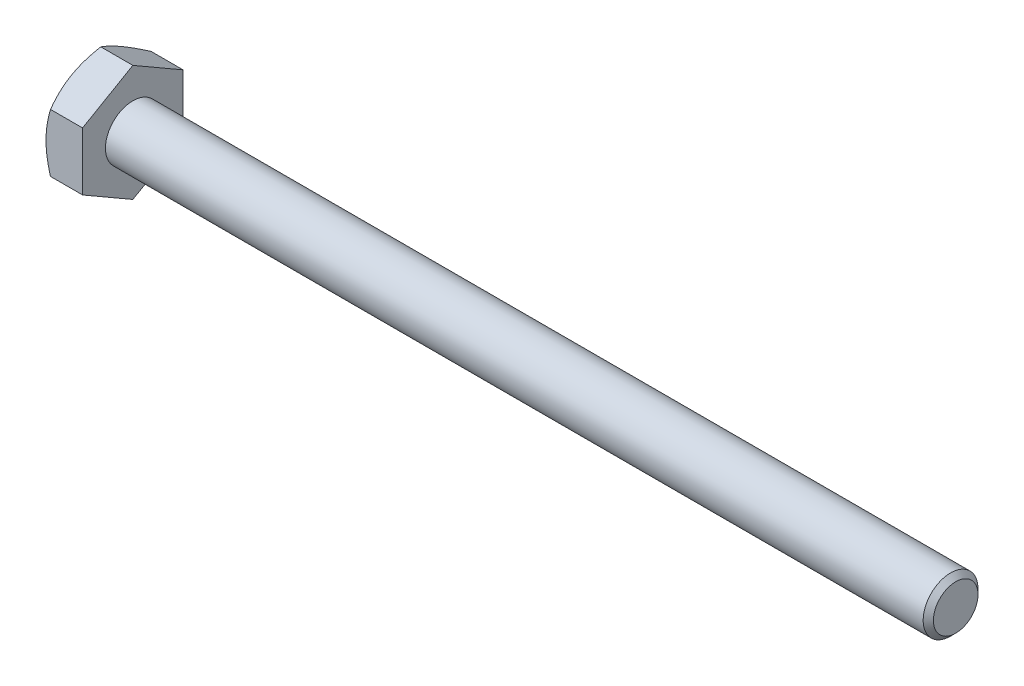
ISO-10303-21;
HEADER;
FILE_DESCRIPTION(('STEP AP214'),'2;1');
FILE_NAME('part.step','',(''),(''),'','','');
FILE_SCHEMA(('AUTOMOTIVE_DESIGN { 1 0 10303 214 1 1 1 1 }'));
ENDSEC;
DATA;
#1=APPLICATION_CONTEXT('core data for automotive mechanical design processes');
#2=APPLICATION_PROTOCOL_DEFINITION('international standard','automotive_design',2000,#1);
#3=PRODUCT_CONTEXT('',#1,'mechanical');
#4=PRODUCT('Part','Part','',(#3));
#5=PRODUCT_RELATED_PRODUCT_CATEGORY('part','',(#4));
#6=PRODUCT_DEFINITION_FORMATION('','',#4);
#7=PRODUCT_DEFINITION_CONTEXT('part definition',#1,'design');
#8=PRODUCT_DEFINITION('design','',#6,#7);
#9=PRODUCT_DEFINITION_SHAPE('','',#8);
#10=(LENGTH_UNIT() NAMED_UNIT(*) SI_UNIT(.MILLI.,.METRE.));
#11=(NAMED_UNIT(*) PLANE_ANGLE_UNIT() SI_UNIT($,.RADIAN.));
#12=(NAMED_UNIT(*) SI_UNIT($,.STERADIAN.) SOLID_ANGLE_UNIT());
#13=UNCERTAINTY_MEASURE_WITH_UNIT(LENGTH_MEASURE(1.E-05),#10,'distance_accuracy_value','');
#14=(GEOMETRIC_REPRESENTATION_CONTEXT(3) GLOBAL_UNCERTAINTY_ASSIGNED_CONTEXT((#13)) GLOBAL_UNIT_ASSIGNED_CONTEXT((#10,
#11,#12)) REPRESENTATION_CONTEXT('',''));
#15=CARTESIAN_POINT('',(0.,0.,0.));
#16=DIRECTION('',(0.,0.,1.));
#17=DIRECTION('',(1.,0.,0.));
#18=AXIS2_PLACEMENT_3D('',#15,#16,#17);
#19=CARTESIAN_POINT('',(0.247093813584343,0.,0.));
#20=DIRECTION('',(1.,0.,0.));
#21=DIRECTION('',(0.,0.,-1.));
#22=AXIS2_PLACEMENT_3D('',#19,#20,#21);
#23=CONICAL_SURFACE('',#22,3.17797903937844,1.04719755121946);
#24=CARTESIAN_POINT('',(0.24562010267378,1.58771322360887,2.75000002886048));
#25=CARTESIAN_POINT('',(0.208302603654191,1.65233281555866,2.63807561243907));
#26=CARTESIAN_POINT('',(0.174113259321967,1.7174699044324,2.52525486505261));
#27=CARTESIAN_POINT('',(0.113820966108115,1.8483182591926,2.29861886652116));
#28=CARTESIAN_POINT('',(0.087678031758483,1.91402496097017,2.18481152064462));
#29=CARTESIAN_POINT('',(0.0555789468438281,2.01320512545803,2.01302643664861));
#30=CARTESIAN_POINT('',(0.046061241370184,2.04639046606418,1.95554774065228));
#31=CARTESIAN_POINT('',(0.0295858947880669,2.1129200190349,1.84031517470215));
#32=CARTESIAN_POINT('',(0.0226281862985192,2.14626422719456,1.78256131203147));
#33=CARTESIAN_POINT('',(0.0113950805088262,2.2132348513754,1.66656478833565));
#34=CARTESIAN_POINT('',(0.00713332390408386,2.24686184378969,1.60832112896836));
#35=CARTESIAN_POINT('',(0.00142988482438796,2.31418196202442,1.49171926381427));
#36=CARTESIAN_POINT('',(-1.12391437539125E-05,2.34787509962031,1.43336103763178));
#37=CARTESIAN_POINT('',(4.72581289227276E-12,2.3815698604072,1.375));
#38=B_SPLINE_CURVE_WITH_KNOTS('',3,(#24,#25,#26,#27,#28,#29,#30,#31,#32,#33,#34,#35,#36,#37),
.UNSPECIFIED.,.F.,.F.,(4,2,2,2,2,2,4),(0.,0.403720170813952,0.805400455121433,1.00650414154214,
1.20760253438159,1.40971045256613,1.61185838561563),.UNSPECIFIED.);
#39=CARTESIAN_POINT('',(0.2456200978637,1.58771323194017,2.75000001443024));
#40=VERTEX_POINT('',#39);
#41=CARTESIAN_POINT('',(2.3630159899092E-12,2.38156986040366,1.37499999999796));
#42=VERTEX_POINT('',#41);
#43=EDGE_CURVE('E99',#40,#42,#38,.T.);
#44=ORIENTED_EDGE('',*,*,#43,.T.);
#45=CARTESIAN_POINT('',(0.,0.,0.));
#46=DIRECTION('',(1.,0.,0.));
#47=DIRECTION('',(0.,0.,-1.));
#48=AXIS2_PLACEMENT_3D('',#45,#46,#47);
#49=CIRCLE('',#48,2.74999999999181);
#50=CARTESIAN_POINT('',(2.36282788152752E-12,0.,2.74999999999591));
#51=VERTEX_POINT('',#50);
#52=EDGE_CURVE('E101',#42,#51,#49,.T.);
#53=ORIENTED_EDGE('',*,*,#52,.T.);
#54=CARTESIAN_POINT('',(4.72565576305503E-12,0.,2.75));
#55=CARTESIAN_POINT('',(-1.12391403169157E-05,0.0673895163245459,2.75));
#56=CARTESIAN_POINT('',(0.00142988460167275,0.134775786268303,2.75));
#57=CARTESIAN_POINT('',(0.00713332279565177,0.269416012274256,2.75));
#58=CARTESIAN_POINT('',(0.0113950787410856,0.336669991887335,2.75));
#59=CARTESIAN_POINT('',(0.022628182811776,0.470611229931942,2.75));
#60=CARTESIAN_POINT('',(0.029585890245106,0.537299641149282,2.75));
#61=CARTESIAN_POINT('',(0.0460612343572212,0.670358736954085,2.75));
#62=CARTESIAN_POINT('',(0.0555789384170422,0.736729413131717,2.75));
#63=CARTESIAN_POINT('',(0.0876780186410727,0.935089727173002,2.75));
#64=CARTESIAN_POINT('',(0.113820949258707,1.06650312094462,2.75));
#65=CARTESIAN_POINT('',(0.174113234142275,1.32819981107932,2.75));
#66=CARTESIAN_POINT('',(0.20830257386764,1.45847397922719,2.75));
#67=CARTESIAN_POINT('',(0.245620068055921,1.58771315367689,2.75));
#68=B_SPLINE_CURVE_WITH_KNOTS('',3,(#54,#55,#56,#57,#58,#59,#60,#61,#62,#63,#64,#65,#66,#67),
.UNSPECIFIED.,.F.,.F.,(4,2,2,2,2,2,4),(0.,0.202147917307363,0.404255819765089,0.60535419706349,
0.806457867940412,1.2081381213207,1.61185826082873),.UNSPECIFIED.);
#69=EDGE_CURVE('E20',#51,#40,#68,.T.);
#70=ORIENTED_EDGE('',*,*,#69,.T.);
#71=EDGE_LOOP('',(#44,#53,#70));
#72=FACE_BOUND('',#71,.T.);
#73=ADVANCED_FACE('F16',(#72),#23,.T.);
#74=CARTESIAN_POINT('',(0.247093813584343,0.,0.));
#75=DIRECTION('',(1.,0.,0.));
#76=DIRECTION('',(0.,0.,-1.));
#77=AXIS2_PLACEMENT_3D('',#74,#75,#76);
#78=CONICAL_SURFACE('',#77,3.17797903937844,1.04719755121946);
#79=CARTESIAN_POINT('',(0.,0.,0.));
#80=DIRECTION('',(1.,0.,0.));
#81=DIRECTION('',(0.,0.,-1.));
#82=AXIS2_PLACEMENT_3D('',#79,#80,#81);
#83=CIRCLE('',#82,2.74999999999181);
#84=CARTESIAN_POINT('',(2.36464317833425E-12,-2.38156986040366,1.37499999999796));
#85=VERTEX_POINT('',#84);
#86=EDGE_CURVE('E108',#51,#85,#83,.T.);
#87=ORIENTED_EDGE('',*,*,#86,.T.);
#88=CARTESIAN_POINT('',(4.72922376022689E-12,-2.38156986040721,1.37500000000001));
#89=CARTESIAN_POINT('',(-1.12391437503857E-05,-2.34787509962045,1.43336103763155));
#90=CARTESIAN_POINT('',(0.0014298848243798,-2.3141819620247,1.4917192638138));
#91=CARTESIAN_POINT('',(0.00713332390402984,-2.24686184379024,1.60832112896742));
#92=CARTESIAN_POINT('',(0.011395080508738,-2.21323485137609,1.66656478833447));
#93=CARTESIAN_POINT('',(0.0226281862983418,-2.14626422719551,1.78256131202983));
#94=CARTESIAN_POINT('',(0.0295858947878346,-2.11292001903599,1.84031517470028));
#95=CARTESIAN_POINT('',(0.0460612413698236,-2.04639046606553,1.95554774064996));
#96=CARTESIAN_POINT('',(0.0555789468433946,-2.01320512545951,2.01302643664606));
#97=CARTESIAN_POINT('',(0.0876780317578065,-1.91402496097204,2.1848115206414));
#98=CARTESIAN_POINT('',(0.113820966107245,-1.84831825919471,2.2986188665175));
#99=CARTESIAN_POINT('',(0.174113259320664,-1.71746990443502,2.52525486504808));
#100=CARTESIAN_POINT('',(0.208302603652649,-1.65233281556153,2.63807561243411));
#101=CARTESIAN_POINT('',(0.245620102671988,-1.58771322361198,2.75000002885509));
#102=B_SPLINE_CURVE_WITH_KNOTS('',3,(#88,#89,#90,#91,#92,#93,#94,#95,#96,#97,#98,#99,#100,#101),
.UNSPECIFIED.,.F.,.F.,(4,2,2,2,2,2,4),(0.,0.202147933048678,0.404255851232406,0.60535424407105,
0.806457930490951,1.20813821479683,1.61185838560916),.UNSPECIFIED.);
#103=CARTESIAN_POINT('',(0.245620080547694,-1.58771319694967,2.75));
#104=VERTEX_POINT('',#103);
#105=EDGE_CURVE('E116',#85,#104,#102,.T.);
#106=ORIENTED_EDGE('',*,*,#105,.T.);
#107=CARTESIAN_POINT('',(0.245620068041765,-1.58771315362786,2.75));
#108=CARTESIAN_POINT('',(0.20830257385546,-1.45847397918202,2.75));
#109=CARTESIAN_POINT('',(0.174113234131979,-1.32819981103807,2.75));
#110=CARTESIAN_POINT('',(0.113820949251817,-1.0665031209113,2.75));
#111=CARTESIAN_POINT('',(0.0876780186357089,-0.935089727143683,2.75));
#112=CARTESIAN_POINT('',(0.0555789384135963,-0.736729413108504,2.75));
#113=CARTESIAN_POINT('',(0.0460612343543534,-0.670358736932932,2.75));
#114=CARTESIAN_POINT('',(0.0295858902432482,-0.537299641132273,2.75));
#115=CARTESIAN_POINT('',(0.0226281828103503,-0.470611229917019,2.75));
#116=CARTESIAN_POINT('',(0.0113950787403629,-0.336669991876632,2.75));
#117=CARTESIAN_POINT('',(0.00713332279519862,-0.269416012265686,2.75));
#118=CARTESIAN_POINT('',(0.00142988460158163,-0.134775786264011,2.75));
#119=CARTESIAN_POINT('',(-1.12391403156188E-05,-0.0673895163223995,2.75));
#120=CARTESIAN_POINT('',(4.72564427270851E-12,0.,2.75));
#121=B_SPLINE_CURVE_WITH_KNOTS('',3,(#107,#108,#109,#110,#111,#112,#113,#114,#115,#116,#117,
#118,#119,#120),.UNSPECIFIED.,.F.,.F.,(4,2,2,2,2,2,4),(0.,0.403720139495227,0.805400392862871,
1.00650406373344,1.20760244102548,1.40971034347678,1.6118582607777),.UNSPECIFIED.);
#122=EDGE_CURVE('E93',#104,#51,#121,.T.);
#123=ORIENTED_EDGE('',*,*,#122,.T.);
#124=EDGE_LOOP('',(#87,#106,#123));
#125=FACE_BOUND('',#124,.T.);
#126=ADVANCED_FACE('F114',(#125),#78,.T.);
#127=CARTESIAN_POINT('',(0.247093813584343,0.,0.));
#128=DIRECTION('',(1.,0.,0.));
#129=DIRECTION('',(0.,0.,-1.));
#130=AXIS2_PLACEMENT_3D('',#127,#128,#129);
#131=CONICAL_SURFACE('',#130,3.17797903937844,1.04719755121946);
#132=CARTESIAN_POINT('',(0.,0.,0.));
#133=DIRECTION('',(1.,0.,0.));
#134=DIRECTION('',(0.,0.,-1.));
#135=AXIS2_PLACEMENT_3D('',#132,#133,#134);
#136=CIRCLE('',#135,2.74999999999181);
#137=CARTESIAN_POINT('',(2.36464430188982E-12,-2.38156986040366,-1.37499999999796));
#138=VERTEX_POINT('',#137);
#139=EDGE_CURVE('E123',#85,#138,#136,.T.);
#140=ORIENTED_EDGE('',*,*,#139,.T.);
#141=CARTESIAN_POINT('',(4.72928860377965E-12,-2.38156986040721,-1.37500000000001));
#142=CARTESIAN_POINT('',(-1.12391437501949E-05,-2.41526462119399,-1.31663896236842));
#143=CARTESIAN_POINT('',(0.00142988482438192,-2.44895775878977,-1.25828073618613));
#144=CARTESIAN_POINT('',(0.00713332390403964,-2.51627787702427,-1.14167887103242));
#145=CARTESIAN_POINT('',(0.0113950805087536,-2.54990486943845,-1.08343521166534));
#146=CARTESIAN_POINT('',(0.0226281862983728,-2.61687549361907,-0.967438687969894));
#147=CARTESIAN_POINT('',(0.0295858947878753,-2.65021970177862,-0.909684825299408));
#148=CARTESIAN_POINT('',(0.0460612413698864,-2.71674925474912,-0.794452259349648));
#149=CARTESIAN_POINT('',(0.0555789468434698,-2.74993459535516,-0.736973563353507));
#150=CARTESIAN_POINT('',(0.0876780317579234,-2.8491147598427,-0.565188479358052));
#151=CARTESIAN_POINT('',(0.113820966107395,-2.91482146162007,-0.451381133481875));
#152=CARTESIAN_POINT('',(0.17411325932089,-3.04566981637985,-0.224745134951144));
#153=CARTESIAN_POINT('',(0.208302603652916,-3.11080690525339,-0.111924387565041));
#154=CARTESIAN_POINT('',(0.245620102672298,-3.17542649720298,2.88560130651261E-08));
#155=B_SPLINE_CURVE_WITH_KNOTS('',3,(#141,#142,#143,#144,#145,#146,#147,#148,#149,#150,#151,
#152,#153,#154),.UNSPECIFIED.,.F.,.F.,(4,2,2,2,2,2,4),(0.,0.202147933048819,0.404255851232687,
0.605354244071471,0.806457930491512,1.20813821479767,1.61185838561028),.UNSPECIFIED.);
#156=CARTESIAN_POINT('',(0.245620080547544,-3.17542645888178,3.75182486861286E-08));
#157=VERTEX_POINT('',#156);
#158=EDGE_CURVE('E183',#138,#157,#155,.T.);
#159=ORIENTED_EDGE('',*,*,#158,.T.);
#160=CARTESIAN_POINT('',(0.245620068041461,-3.17542643722061,7.50364969385818E-08));
#161=CARTESIAN_POINT('',(0.208302573855199,-3.11080684999773,0.111924483270649));
#162=CARTESIAN_POINT('',(0.174113234131759,-3.0456697659258,0.224745222340119));
#163=CARTESIAN_POINT('',(0.11382094925167,-2.9148214208625,0.451381204076056));
#164=CARTESIAN_POINT('',(0.0876780186355958,-2.84911472397873,0.565188541476268));
#165=CARTESIAN_POINT('',(0.0555789384135252,-2.74993456696121,0.736973612533276));
#166=CARTESIAN_POINT('',(0.0460612343542949,-2.71674922887345,0.794452304167634));
#167=CARTESIAN_POINT('',(0.0295858902432116,-2.65021968097316,0.909684861335514));
#168=CARTESIAN_POINT('',(0.0226281828103228,-2.61687547536556,0.967438719585908));
#169=CARTESIAN_POINT('',(0.0113950787403507,-2.54990485634541,1.08343523434314));
#170=CARTESIAN_POINT('',(0.00713332279519246,-2.51627786653996,1.14167888919178));
#171=CARTESIAN_POINT('',(0.0014298846015836,-2.44895775353917,1.25828074528043));
#172=CARTESIAN_POINT('',(-1.12391403115827E-05,-2.41526461856839,1.3166389669161));
#173=CARTESIAN_POINT('',(4.72934450508175E-12,-2.38156986040721,1.37500000000001));
#174=B_SPLINE_CURVE_WITH_KNOTS('',3,(#160,#161,#162,#163,#164,#165,#166,#167,#168,#169,#170,
#171,#172,#173),.UNSPECIFIED.,.F.,.F.,(4,2,2,2,2,2,4),(0.,0.40372013949495,0.805400392862319,
1.00650406373275,1.20760244102465,1.40971034347581,1.6118582607766),.UNSPECIFIED.);
#175=EDGE_CURVE('E201',#157,#85,#174,.T.);
#176=ORIENTED_EDGE('',*,*,#175,.T.);
#177=EDGE_LOOP('',(#140,#159,#176));
#178=FACE_BOUND('',#177,.T.);
#179=ADVANCED_FACE('F165',(#178),#131,.T.);
#180=CARTESIAN_POINT('',(0.247093813584343,0.,0.));
#181=DIRECTION('',(1.,0.,0.));
#182=DIRECTION('',(0.,0.,-1.));
#183=AXIS2_PLACEMENT_3D('',#180,#181,#182);
#184=CONICAL_SURFACE('',#183,3.17797903937844,1.04719755121946);
#185=CARTESIAN_POINT('',(0.,0.,0.));
#186=DIRECTION('',(1.,0.,0.));
#187=DIRECTION('',(0.,0.,-1.));
#188=AXIS2_PLACEMENT_3D('',#185,#186,#187);
#189=CIRCLE('',#188,2.74999999999181);
#190=CARTESIAN_POINT('',(2.36301567085236E-12,0.,-2.74999999999591));
#191=VERTEX_POINT('',#190);
#192=EDGE_CURVE('E129',#138,#191,#189,.T.);
#193=ORIENTED_EDGE('',*,*,#192,.T.);
#194=CARTESIAN_POINT('',(4.72603134170472E-12,0.,-2.75));
#195=CARTESIAN_POINT('',(-1.12391437535286E-05,-0.0673895215734155,-2.75));
#196=CARTESIAN_POINT('',(0.00142988482437251,-0.134775796764826,-2.75));
#197=CARTESIAN_POINT('',(0.00713332390400646,-0.269416033233554,-2.75));
#198=CARTESIAN_POINT('',(0.0113950805087027,-0.336670018061767,-2.75));
#199=CARTESIAN_POINT('',(0.0226281862982756,-0.470611266422736,-2.75));
#200=CARTESIAN_POINT('',(0.0295858947877495,-0.537299682741689,-2.75));
#201=CARTESIAN_POINT('',(0.0460612413696938,-0.670358788682425,-2.75));
#202=CARTESIAN_POINT('',(0.055578946843239,-0.73672946989437,-2.75));
#203=CARTESIAN_POINT('',(0.0876780317575655,-0.935089798869043,-2.75));
#204=CARTESIAN_POINT('',(0.113820966106936,-1.06650320242351,-2.75));
#205=CARTESIAN_POINT('',(0.174113259320205,-1.32819991194254,-2.75));
#206=CARTESIAN_POINT('',(0.208302603652107,-1.45847408968937,-2.75));
#207=CARTESIAN_POINT('',(0.245620102671358,-1.58771327358829,-2.75));
#208=B_SPLINE_CURVE_WITH_KNOTS('',3,(#194,#195,#196,#197,#198,#199,#200,#201,#202,#203,#204,
#205,#206,#207),.UNSPECIFIED.,.F.,.F.,(4,2,2,2,2,2,4),(0.,0.202147933048393,0.404255851231836,
0.605354244070199,0.806457930489819,1.20813821479514,1.6118583856069),.UNSPECIFIED.);
#209=CARTESIAN_POINT('',(0.245620080548032,-1.58771326193192,-2.74999996248315));
#210=VERTEX_POINT('',#209);
#211=EDGE_CURVE('E169',#191,#210,#208,.T.);
#212=ORIENTED_EDGE('',*,*,#211,.T.);
#213=CARTESIAN_POINT('',(0.245620068042392,-1.5877132835922,-2.74999992496631));
#214=CARTESIAN_POINT('',(0.208302573856,-1.6523328708152,-2.63807551673193));
#215=CARTESIAN_POINT('',(0.174113234132436,-1.71746995488726,-2.52525477766224));
#216=CARTESIAN_POINT('',(0.113820949252124,-1.84831829995082,-2.29861879592585));
#217=CARTESIAN_POINT('',(0.0876780186359484,-1.91402499683472,-2.18481145852541));
#218=CARTESIAN_POINT('',(0.0555789384137517,-2.01320515385245,-2.01302638746806));
#219=CARTESIAN_POINT('',(0.0460612343544835,-2.04639049194028,-1.95554769583358));
#220=CARTESIAN_POINT('',(0.0295858902433337,-2.1129200398407,-1.84031513866546));
#221=CARTESIAN_POINT('',(0.0226281828104164,-2.14626424544837,-1.78256128041495));
#222=CARTESIAN_POINT('',(0.0113950787403979,-2.21323486446866,-1.66656476565748));
#223=CARTESIAN_POINT('',(0.00713332279522201,-2.24686185427418,-1.60832111080872));
#224=CARTESIAN_POINT('',(0.00142988460158942,-2.31418196727511,-1.49171925471982));
#225=CARTESIAN_POINT('',(-1.12391403117872E-05,-2.34787510224596,-1.43336103308403));
#226=CARTESIAN_POINT('',(4.72923002787203E-12,-2.38156986040721,-1.375));
#227=B_SPLINE_CURVE_WITH_KNOTS('',3,(#213,#214,#215,#216,#217,#218,#219,#220,#221,#222,#223,
#224,#225,#226),.UNSPECIFIED.,.F.,.F.,(4,2,2,2,2,2,4),(0.,0.403720139495791,0.805400392863992,
1.00650406373484,1.20760244102716,1.40971034347874,1.61185826077995),.UNSPECIFIED.);
#228=EDGE_CURVE('E175',#210,#138,#227,.T.);
#229=ORIENTED_EDGE('',*,*,#228,.T.);
#230=EDGE_LOOP('',(#193,#212,#229));
#231=FACE_BOUND('',#230,.T.);
#232=ADVANCED_FACE('F158',(#231),#184,.T.);
#233=CARTESIAN_POINT('',(0.247093813584343,0.,0.));
#234=DIRECTION('',(1.,0.,0.));
#235=DIRECTION('',(0.,0.,-1.));
#236=AXIS2_PLACEMENT_3D('',#233,#234,#235);
#237=CONICAL_SURFACE('',#236,3.17797903937844,1.04719755121946);
#238=CARTESIAN_POINT('',(0.245620102671646,1.58771327358929,-2.75));
#239=CARTESIAN_POINT('',(0.208302603652355,1.45847408969029,-2.75));
#240=CARTESIAN_POINT('',(0.174113259320415,1.32819991194339,-2.75));
#241=CARTESIAN_POINT('',(0.113820966107077,1.06650320242419,-2.75));
#242=CARTESIAN_POINT('',(0.0876780317576748,0.935089798869642,-2.75));
#243=CARTESIAN_POINT('',(0.0555789468433089,0.736729469894844,-2.75));
#244=CARTESIAN_POINT('',(0.046061241369752,0.670358788682857,-2.75));
#245=CARTESIAN_POINT('',(0.029585894787787,0.537299682742037,-2.75));
#246=CARTESIAN_POINT('',(0.0226281862983043,0.470611266423041,-2.75));
#247=CARTESIAN_POINT('',(0.0113950805087172,0.336670018061985,-2.75));
#248=CARTESIAN_POINT('',(0.00713332390401551,0.269416033233729,-2.75));
#249=CARTESIAN_POINT('',(0.00142988482437428,0.134775796764914,-2.75));
#250=CARTESIAN_POINT('',(-1.12391437535898E-05,0.0673895215734597,-2.75));
#251=CARTESIAN_POINT('',(4.72603085714641E-12,0.,-2.75));
#252=B_SPLINE_CURVE_WITH_KNOTS('',3,(#238,#239,#240,#241,#242,#243,#244,#245,#246,#247,#248,
#249,#250,#251),.UNSPECIFIED.,.F.,.F.,(4,2,2,2,2,2,4),(0.,0.403720170812023,0.805400455117598,
1.00650414153735,1.20760253437584,1.40971045255941,1.61185838560794),.UNSPECIFIED.);
#253=CARTESIAN_POINT('',(0.245620097862634,1.58771325693038,-2.75));
#254=VERTEX_POINT('',#253);
#255=EDGE_CURVE('E109',#254,#191,#252,.T.);
#256=ORIENTED_EDGE('',*,*,#255,.T.);
#257=CARTESIAN_POINT('',(0.,0.,0.));
#258=DIRECTION('',(1.,0.,0.));
#259=DIRECTION('',(0.,0.,-1.));
#260=AXIS2_PLACEMENT_3D('',#257,#258,#259);
#261=CIRCLE('',#260,2.74999999999181);
#262=CARTESIAN_POINT('',(2.36298517466423E-12,2.38156986040366,-1.37499999999796));
#263=VERTEX_POINT('',#262);
#264=EDGE_CURVE('E376',#191,#263,#261,.T.);
#265=ORIENTED_EDGE('',*,*,#264,.T.);
#266=CARTESIAN_POINT('',(4.72615813865329E-12,2.3815698604072,-1.375));
#267=CARTESIAN_POINT('',(-1.12391403149998E-05,2.34787510224598,-1.43336103308399));
#268=CARTESIAN_POINT('',(0.00142988460158435,2.31418196727515,-1.49171925471975));
#269=CARTESIAN_POINT('',(0.00713332279520972,2.24686185427426,-1.60832111080856));
#270=CARTESIAN_POINT('',(0.0113950787403803,2.21323486446876,-1.66656476565729));
#271=CARTESIAN_POINT('',(0.0226281828103846,2.14626424544852,-1.78256128041469));
#272=CARTESIAN_POINT('',(0.0295858902432931,2.11292003984086,-1.84031513866517));
#273=CARTESIAN_POINT('',(0.0460612343544224,2.04639049194049,-1.95554769583321));
#274=CARTESIAN_POINT('',(0.055578938413679,2.01320515385268,-2.01302638746765));
#275=CARTESIAN_POINT('',(0.0876780186358369,1.91402499683501,-2.1848114585249));
#276=CARTESIAN_POINT('',(0.113820949251981,1.84831829995116,-2.29861879592527));
#277=CARTESIAN_POINT('',(0.174113234132225,1.71746995488768,-2.52525477766152));
#278=CARTESIAN_POINT('',(0.208302573855751,1.65233287081565,-2.63807551673114));
#279=CARTESIAN_POINT('',(0.245620068042103,1.58771328359269,-2.74999992496544));
#280=B_SPLINE_CURVE_WITH_KNOTS('',3,(#266,#267,#268,#269,#270,#271,#272,#273,#274,#275,#276,
#277,#278,#279),.UNSPECIFIED.,.F.,.F.,(4,2,2,2,2,2,4),(0.,0.202147917301079,0.404255819752529,
0.605354197044726,0.806457867915443,1.20813812128339,1.61185826077892),.UNSPECIFIED.);
#281=EDGE_CURVE('E142',#263,#254,#280,.T.);
#282=ORIENTED_EDGE('',*,*,#281,.T.);
#283=EDGE_LOOP('',(#256,#265,#282));
#284=FACE_BOUND('',#283,.T.);
#285=ADVANCED_FACE('F153',(#284),#237,.T.);
#286=CARTESIAN_POINT('',(0.,3.17542648054294,0.));
#287=DIRECTION('',(1.,0.,0.));
#288=DIRECTION('',(0.,0.,-1.));
#289=AXIS2_PLACEMENT_3D('',#286,#287,#288);
#290=PLANE('',#289);
#291=ORIENTED_EDGE('',*,*,#192,.F.);
#292=ORIENTED_EDGE('',*,*,#139,.F.);
#293=ORIENTED_EDGE('',*,*,#86,.F.);
#294=ORIENTED_EDGE('',*,*,#52,.F.);
#295=CARTESIAN_POINT('',(0.,0.,0.));
#296=DIRECTION('',(1.,0.,0.));
#297=DIRECTION('',(0.,0.,-1.));
#298=AXIS2_PLACEMENT_3D('',#295,#296,#297);
#299=CIRCLE('',#298,2.74999999999181);
#300=EDGE_CURVE('E373',#263,#42,#299,.T.);
#301=ORIENTED_EDGE('',*,*,#300,.F.);
#302=ORIENTED_EDGE('',*,*,#264,.F.);
#303=EDGE_LOOP('',(#291,#292,#293,#294,#301,#302));
#304=FACE_BOUND('',#303,.T.);
#305=ADVANCED_FACE('F121',(#304),#290,.F.);
#306=CARTESIAN_POINT('',(0.247093813584343,0.,0.));
#307=DIRECTION('',(1.,0.,0.));
#308=DIRECTION('',(0.,0.,-1.));
#309=AXIS2_PLACEMENT_3D('',#306,#307,#308);
#310=CONICAL_SURFACE('',#309,3.17797903937844,1.04719755121946);
#311=CARTESIAN_POINT('',(0.245620093054257,3.17542648054404,1.90076577879672E-12));
#312=CARTESIAN_POINT('',(0.208302595377179,3.1108068899072,-0.111924414145401));
#313=CARTESIAN_POINT('',(0.174113252325098,3.04566980236722,-0.224745159221722));
#314=CARTESIAN_POINT('',(0.113820961426044,2.91482145030045,-0.451381153088027));
#315=CARTESIAN_POINT('',(0.0876780281134501,2.84911474988218,-0.565188496610171));
#316=CARTESIAN_POINT('',(0.0555789445022141,2.74993458746929,-0.736973577012226));
#317=CARTESIAN_POINT('',(0.0460612394214395,2.71674924756265,-0.794452271796967));
#318=CARTESIAN_POINT('',(0.0295858935256803,2.6502196960003,-0.909684835307731));
#319=CARTESIAN_POINT('',(0.0226281853296317,2.61687548854951,-0.967438696750622));
#320=CARTESIAN_POINT('',(0.0113950800176109,2.54990486580211,-1.08343521796365));
#321=CARTESIAN_POINT('',(0.00713332359607554,2.51627787411245,-1.14167887607583));
#322=CARTESIAN_POINT('',(0.00142988476250048,2.44895775733151,-1.25828073871189));
#323=CARTESIAN_POINT('',(-1.12391427987271E-05,2.41526462046477,-1.31663896363145));
#324=CARTESIAN_POINT('',(4.72607735642762E-12,2.3815698604072,-1.375));
#325=B_SPLINE_CURVE_WITH_KNOTS('',3,(#311,#312,#313,#314,#315,#316,#317,#318,#319,#320,#321,
#322,#323,#324),.UNSPECIFIED.,.F.,.F.,(4,2,2,2,2,2,4),(0.,0.403720162114742,0.805400437828253,
1.00650411992969,1.20760250845064,1.40971042226505,1.61185835094016),.UNSPECIFIED.);
#326=CARTESIAN_POINT('',(0.245620093054257,3.17542648054404,0.));
#327=VERTEX_POINT('',#326);
#328=EDGE_CURVE('E272',#327,#263,#325,.T.);
#329=ORIENTED_EDGE('',*,*,#328,.T.);
#330=ORIENTED_EDGE('',*,*,#300,.T.);
#331=CARTESIAN_POINT('',(4.7258761186801E-12,2.3815698604072,1.375));
#332=CARTESIAN_POINT('',(-1.12391427987737E-05,2.41526462046477,1.31663896363145));
#333=CARTESIAN_POINT('',(0.00142988476250046,2.44895775733151,1.25828073871189));
#334=CARTESIAN_POINT('',(0.00713332359607553,2.51627787411245,1.14167887607583));
#335=CARTESIAN_POINT('',(0.0113950800176108,2.54990486580211,1.08343521796365));
#336=CARTESIAN_POINT('',(0.0226281853296318,2.61687548854951,0.967438696750622));
#337=CARTESIAN_POINT('',(0.0295858935256804,2.6502196960003,0.90968483530773));
#338=CARTESIAN_POINT('',(0.0460612394214397,2.71674924756265,0.794452271796966));
#339=CARTESIAN_POINT('',(0.0555789445022143,2.74993458746929,0.736973577012225));
#340=CARTESIAN_POINT('',(0.0876780281134504,2.84911474988218,0.565188496610171));
#341=CARTESIAN_POINT('',(0.113820961426044,2.91482145030045,0.451381153088027));
#342=CARTESIAN_POINT('',(0.174113252325097,3.04566980236722,0.224745159221722));
#343=CARTESIAN_POINT('',(0.208302595377179,3.11080688990721,0.111924414145401));
#344=CARTESIAN_POINT('',(0.245620093054257,3.17542648054404,-1.90066565217538E-12));
#345=B_SPLINE_CURVE_WITH_KNOTS('',3,(#331,#332,#333,#334,#335,#336,#337,#338,#339,#340,#341,
#342,#343,#344),.UNSPECIFIED.,.F.,.F.,(4,2,2,2,2,2,4),(0.,0.202147928675111,0.404255842489526,
0.605354231010469,0.806457913111909,1.20813818882542,1.61185835094016),.UNSPECIFIED.);
#346=EDGE_CURVE('E264',#42,#327,#345,.T.);
#347=ORIENTED_EDGE('',*,*,#346,.T.);
#348=EDGE_LOOP('',(#329,#330,#347));
#349=FACE_BOUND('',#348,.T.);
#350=ADVANCED_FACE('F280',(#349),#310,.T.);
#351=CARTESIAN_POINT('',(47.,0.,0.));
#352=DIRECTION('',(-1.,0.,0.));
#353=DIRECTION('',(0.,0.,1.));
#354=AXIS2_PLACEMENT_3D('',#351,#352,#353);
#355=PLANE('',#354);
#356=CARTESIAN_POINT('',(47.0000000000255,0.,0.));
#357=DIRECTION('',(-1.,0.,0.));
#358=DIRECTION('',(0.,0.,1.));
#359=AXIS2_PLACEMENT_3D('',#356,#357,#358);
#360=CIRCLE('',#359,1.2194999999906);
#361=CARTESIAN_POINT('',(47.0000000000255,0.,1.2194999999906));
#362=VERTEX_POINT('',#361);
#363=EDGE_CURVE('E248',#362,#362,#360,.T.);
#364=ORIENTED_EDGE('',*,*,#363,.F.);
#365=EDGE_LOOP('',(#364));
#366=FACE_BOUND('',#365,.T.);
#367=ADVANCED_FACE('F284',(#366),#355,.F.);
#368=CARTESIAN_POINT('',(2.,1.58771324027147,-2.75));
#369=DIRECTION('',(0.,-0.866025403784438,0.500000000000001));
#370=DIRECTION('',(0.,-0.500000000000001,-0.866025403784438));
#371=AXIS2_PLACEMENT_3D('',#368,#369,#370);
#372=PLANE('',#371);
#373=DIRECTION('',(1.,0.,0.));
#374=VECTOR('',#373,1.);
#375=CARTESIAN_POINT('',(2.,3.17542648054294,0.));
#376=LINE('',#375,#374);
#377=CARTESIAN_POINT('',(2.,3.17542648054294,0.));
#378=VERTEX_POINT('',#377);
#379=EDGE_CURVE('E271',#327,#378,#376,.T.);
#380=ORIENTED_EDGE('',*,*,#379,.T.);
#381=DIRECTION('',(0.,0.500000000000001,0.866025403784438));
#382=VECTOR('',#381,1.);
#383=CARTESIAN_POINT('',(2.,1.58771324027147,-2.75));
#384=LINE('',#383,#382);
#385=CARTESIAN_POINT('',(2.,1.58771324027147,-2.75));
#386=VERTEX_POINT('',#385);
#387=EDGE_CURVE('E251',#386,#378,#384,.T.);
#388=ORIENTED_EDGE('',*,*,#387,.F.);
#389=DIRECTION('',(1.,0.,0.));
#390=VECTOR('',#389,1.);
#391=CARTESIAN_POINT('',(2.,1.58771324027147,-2.75));
#392=LINE('',#391,#390);
#393=EDGE_CURVE('E252',#386,#254,#392,.F.);
#394=ORIENTED_EDGE('',*,*,#393,.T.);
#395=ORIENTED_EDGE('',*,*,#281,.F.);
#396=ORIENTED_EDGE('',*,*,#328,.F.);
#397=EDGE_LOOP('',(#380,#388,#394,#395,#396));
#398=FACE_BOUND('',#397,.T.);
#399=ADVANCED_FACE('F288',(#398),#372,.F.);
#400=CARTESIAN_POINT('',(2.,3.17542648054294,0.));
#401=DIRECTION('',(0.,-0.866025403784438,-0.500000000000001));
#402=DIRECTION('',(0.,0.500000000000001,-0.866025403784438));
#403=AXIS2_PLACEMENT_3D('',#400,#401,#402);
#404=PLANE('',#403);
#405=DIRECTION('',(1.,0.,0.));
#406=VECTOR('',#405,1.);
#407=CARTESIAN_POINT('',(2.,1.58771324027147,2.75));
#408=LINE('',#407,#406);
#409=CARTESIAN_POINT('',(2.,1.58771324027147,2.75));
#410=VERTEX_POINT('',#409);
#411=EDGE_CURVE('E96',#40,#410,#408,.T.);
#412=ORIENTED_EDGE('',*,*,#411,.T.);
#413=DIRECTION('',(0.,-0.500000000000001,0.866025403784438));
#414=VECTOR('',#413,1.);
#415=CARTESIAN_POINT('',(2.,3.17542648054294,0.));
#416=LINE('',#415,#414);
#417=EDGE_CURVE('E258',#378,#410,#416,.T.);
#418=ORIENTED_EDGE('',*,*,#417,.F.);
#419=ORIENTED_EDGE('',*,*,#379,.F.);
#420=ORIENTED_EDGE('',*,*,#346,.F.);
#421=ORIENTED_EDGE('',*,*,#43,.F.);
#422=EDGE_LOOP('',(#412,#418,#419,#420,#421));
#423=FACE_BOUND('',#422,.T.);
#424=ADVANCED_FACE('F278',(#423),#404,.F.);
#425=CARTESIAN_POINT('',(2.,1.58771324027147,2.75));
#426=DIRECTION('',(0.,0.,-1.));
#427=DIRECTION('',(0.,1.,0.));
#428=AXIS2_PLACEMENT_3D('',#425,#426,#427);
#429=PLANE('',#428);
#430=DIRECTION('',(1.,0.,0.));
#431=VECTOR('',#430,1.);
#432=CARTESIAN_POINT('',(2.,-1.58771324027148,2.75));
#433=LINE('',#432,#431);
#434=CARTESIAN_POINT('',(2.,-1.58771324027148,2.75));
#435=VERTEX_POINT('',#434);
#436=EDGE_CURVE('E342',#104,#435,#433,.T.);
#437=ORIENTED_EDGE('',*,*,#436,.T.);
#438=DIRECTION('',(0.,1.,0.));
#439=VECTOR('',#438,1.);
#440=CARTESIAN_POINT('',(2.,3.17542648054294,2.75));
#441=LINE('',#440,#439);
#442=EDGE_CURVE('E310',#410,#435,#441,.F.);
#443=ORIENTED_EDGE('',*,*,#442,.F.);
#444=ORIENTED_EDGE('',*,*,#411,.F.);
#445=ORIENTED_EDGE('',*,*,#69,.F.);
#446=ORIENTED_EDGE('',*,*,#122,.F.);
#447=EDGE_LOOP('',(#437,#443,#444,#445,#446));
#448=FACE_BOUND('',#447,.T.);
#449=ADVANCED_FACE('F91',(#448),#429,.F.);
#450=CARTESIAN_POINT('',(2.,-3.17542648054295,0.));
#451=DIRECTION('',(0.,0.866025403784438,-0.500000000000001));
#452=DIRECTION('',(0.,0.500000000000001,0.866025403784438));
#453=AXIS2_PLACEMENT_3D('',#450,#451,#452);
#454=PLANE('',#453);
#455=DIRECTION('',(1.,0.,0.));
#456=VECTOR('',#455,1.);
#457=CARTESIAN_POINT('',(2.,-3.17542648054295,0.));
#458=LINE('',#457,#456);
#459=CARTESIAN_POINT('',(2.,-3.17542648054295,0.));
#460=VERTEX_POINT('',#459);
#461=EDGE_CURVE('E344',#157,#460,#458,.T.);
#462=ORIENTED_EDGE('',*,*,#461,.T.);
#463=DIRECTION('',(0.,-0.500000000000001,-0.866025403784438));
#464=VECTOR('',#463,1.);
#465=CARTESIAN_POINT('',(2.,-1.58771324027148,2.75));
#466=LINE('',#465,#464);
#467=EDGE_CURVE('E323',#435,#460,#466,.T.);
#468=ORIENTED_EDGE('',*,*,#467,.F.);
#469=ORIENTED_EDGE('',*,*,#436,.F.);
#470=ORIENTED_EDGE('',*,*,#105,.F.);
#471=ORIENTED_EDGE('',*,*,#175,.F.);
#472=EDGE_LOOP('',(#462,#468,#469,#470,#471));
#473=FACE_BOUND('',#472,.T.);
#474=ADVANCED_FACE('F193',(#473),#454,.F.);
#475=CARTESIAN_POINT('',(2.,-1.58771324027148,-2.75));
#476=DIRECTION('',(0.,0.866025403784438,0.500000000000001));
#477=DIRECTION('',(0.,-0.500000000000001,0.866025403784438));
#478=AXIS2_PLACEMENT_3D('',#475,#476,#477);
#479=PLANE('',#478);
#480=DIRECTION('',(1.,0.,0.));
#481=VECTOR('',#480,1.);
#482=CARTESIAN_POINT('',(2.,-1.58771324027164,-2.75));
#483=LINE('',#482,#481);
#484=CARTESIAN_POINT('',(2.,-1.58771324027158,-2.75));
#485=VERTEX_POINT('',#484);
#486=EDGE_CURVE('E41',#210,#485,#483,.T.);
#487=ORIENTED_EDGE('',*,*,#486,.T.);
#488=DIRECTION('',(0.,0.500000000000001,-0.866025403784438));
#489=VECTOR('',#488,1.);
#490=CARTESIAN_POINT('',(2.,-3.17542648054295,0.));
#491=LINE('',#490,#489);
#492=EDGE_CURVE('E316',#460,#485,#491,.T.);
#493=ORIENTED_EDGE('',*,*,#492,.F.);
#494=ORIENTED_EDGE('',*,*,#461,.F.);
#495=ORIENTED_EDGE('',*,*,#158,.F.);
#496=ORIENTED_EDGE('',*,*,#228,.F.);
#497=EDGE_LOOP('',(#487,#493,#494,#495,#496));
#498=FACE_BOUND('',#497,.T.);
#499=ADVANCED_FACE('F189',(#498),#479,.F.);
#500=CARTESIAN_POINT('',(2.,1.58771324027147,-2.75));
#501=DIRECTION('',(0.,0.,1.));
#502=DIRECTION('',(0.,-1.,0.));
#503=AXIS2_PLACEMENT_3D('',#500,#501,#502);
#504=PLANE('',#503);
#505=ORIENTED_EDGE('',*,*,#393,.F.);
#506=DIRECTION('',(0.,1.,0.));
#507=VECTOR('',#506,1.);
#508=CARTESIAN_POINT('',(2.,3.17542648054294,-2.75));
#509=LINE('',#508,#507);
#510=EDGE_CURVE('E314',#485,#386,#509,.T.);
#511=ORIENTED_EDGE('',*,*,#510,.F.);
#512=ORIENTED_EDGE('',*,*,#486,.F.);
#513=ORIENTED_EDGE('',*,*,#211,.F.);
#514=ORIENTED_EDGE('',*,*,#255,.F.);
#515=EDGE_LOOP('',(#505,#511,#512,#513,#514));
#516=FACE_BOUND('',#515,.T.);
#517=ADVANCED_FACE('F149',(#516),#504,.F.);
#518=CARTESIAN_POINT('',(46.7195000000515,0.,0.));
#519=DIRECTION('',(-1.,0.,0.));
#520=DIRECTION('',(0.,0.,1.));
#521=AXIS2_PLACEMENT_3D('',#518,#519,#520);
#522=CONICAL_SURFACE('',#521,1.49999999996453,0.785398163397448);
#523=CARTESIAN_POINT('',(46.7195,0.,0.));
#524=DIRECTION('',(-1.,0.,0.));
#525=DIRECTION('',(0.,0.,1.));
#526=AXIS2_PLACEMENT_3D('',#523,#524,#525);
#527=CIRCLE('',#526,1.5);
#528=CARTESIAN_POINT('',(46.7195,0.,1.5));
#529=VERTEX_POINT('',#528);
#530=EDGE_CURVE('E32',#529,#529,#527,.T.);
#531=ORIENTED_EDGE('',*,*,#530,.F.);
#532=EDGE_LOOP('',(#531));
#533=FACE_BOUND('',#532,.T.);
#534=ORIENTED_EDGE('',*,*,#363,.T.);
#535=EDGE_LOOP('',(#534));
#536=FACE_BOUND('',#535,.T.);
#537=ADVANCED_FACE('F233',(#533,#536),#522,.T.);
#538=CARTESIAN_POINT('',(2.,3.17542648054294,0.));
#539=DIRECTION('',(1.,0.,0.));
#540=DIRECTION('',(0.,0.,-1.));
#541=AXIS2_PLACEMENT_3D('',#538,#539,#540);
#542=PLANE('',#541);
#543=CARTESIAN_POINT('',(2.,0.,0.));
#544=DIRECTION('',(-1.,0.,0.));
#545=DIRECTION('',(0.,0.,1.));
#546=AXIS2_PLACEMENT_3D('',#543,#544,#545);
#547=CIRCLE('',#546,1.5);
#548=CARTESIAN_POINT('',(2.,0.,1.5));
#549=VERTEX_POINT('',#548);
#550=EDGE_CURVE('E11',#549,#549,#547,.F.);
#551=ORIENTED_EDGE('',*,*,#550,.F.);
#552=EDGE_LOOP('',(#551));
#553=FACE_BOUND('',#552,.T.);
#554=ORIENTED_EDGE('',*,*,#492,.T.);
#555=ORIENTED_EDGE('',*,*,#510,.T.);
#556=ORIENTED_EDGE('',*,*,#387,.T.);
#557=ORIENTED_EDGE('',*,*,#417,.T.);
#558=ORIENTED_EDGE('',*,*,#442,.T.);
#559=ORIENTED_EDGE('',*,*,#467,.T.);
#560=EDGE_LOOP('',(#554,#555,#556,#557,#558,#559));
#561=FACE_BOUND('',#560,.T.);
#562=ADVANCED_FACE('F227',(#553,#561),#542,.T.);
#563=CARTESIAN_POINT('',(0.,0.,0.));
#564=DIRECTION('',(-1.,0.,0.));
#565=DIRECTION('',(0.,0.,1.));
#566=AXIS2_PLACEMENT_3D('',#563,#564,#565);
#567=CYLINDRICAL_SURFACE('',#566,1.5);
#568=ORIENTED_EDGE('',*,*,#550,.T.);
#569=EDGE_LOOP('',(#568));
#570=FACE_BOUND('',#569,.T.);
#571=ORIENTED_EDGE('',*,*,#530,.T.);
#572=EDGE_LOOP('',(#571));
#573=FACE_BOUND('',#572,.T.);
#574=ADVANCED_FACE('F225',(#570,#573),#567,.T.);
#575=CLOSED_SHELL('',(#73,#126,#179,#232,#285,#305,#350,#367,#399,#424,#449,#474,#499,#517,#537,
#562,#574));
#576=MANIFOLD_SOLID_BREP('B1',#575);
#577=ADVANCED_BREP_SHAPE_REPRESENTATION('',(#18,#576),#14);
#578=SHAPE_DEFINITION_REPRESENTATION(#9,#577);
ENDSEC;
END-ISO-10303-21;
